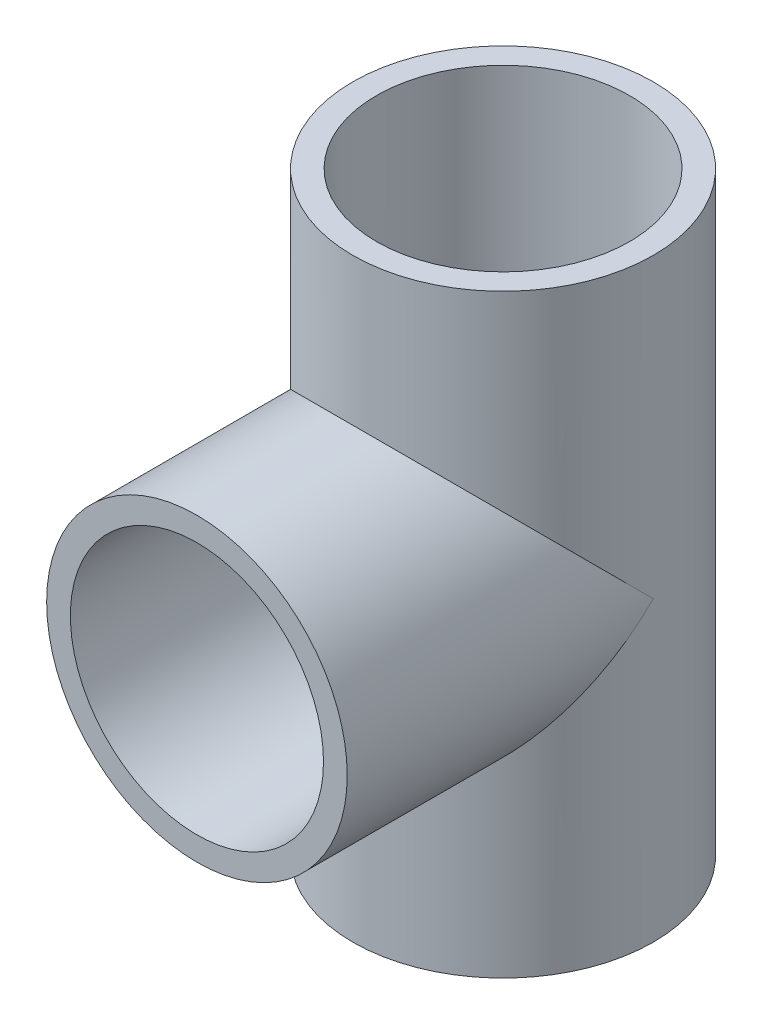
ISO-10303-21;
HEADER;
FILE_DESCRIPTION(('STEP AP214'),'2;1');
FILE_NAME('part.step','',(''),(''),'','','');
FILE_SCHEMA(('AUTOMOTIVE_DESIGN { 1 0 10303 214 1 1 1 1 }'));
ENDSEC;
DATA;
#1=APPLICATION_CONTEXT('core data for automotive mechanical design processes');
#2=APPLICATION_PROTOCOL_DEFINITION('international standard','automotive_design',2000,#1);
#3=PRODUCT_CONTEXT('',#1,'mechanical');
#4=PRODUCT('Part','Part','',(#3));
#5=PRODUCT_RELATED_PRODUCT_CATEGORY('part','',(#4));
#6=PRODUCT_DEFINITION_FORMATION('','',#4);
#7=PRODUCT_DEFINITION_CONTEXT('part definition',#1,'design');
#8=PRODUCT_DEFINITION('design','',#6,#7);
#9=PRODUCT_DEFINITION_SHAPE('','',#8);
#10=(LENGTH_UNIT() NAMED_UNIT(*) SI_UNIT(.MILLI.,.METRE.));
#11=(NAMED_UNIT(*) PLANE_ANGLE_UNIT() SI_UNIT($,.RADIAN.));
#12=(NAMED_UNIT(*) SI_UNIT($,.STERADIAN.) SOLID_ANGLE_UNIT());
#13=UNCERTAINTY_MEASURE_WITH_UNIT(LENGTH_MEASURE(1.E-05),#10,'distance_accuracy_value','');
#14=(GEOMETRIC_REPRESENTATION_CONTEXT(3) GLOBAL_UNCERTAINTY_ASSIGNED_CONTEXT((#13)) GLOBAL_UNIT_ASSIGNED_CONTEXT((#10,
#11,#12)) REPRESENTATION_CONTEXT('',''));
#15=CARTESIAN_POINT('',(0.,0.,0.));
#16=DIRECTION('',(0.,0.,1.));
#17=DIRECTION('',(1.,0.,0.));
#18=AXIS2_PLACEMENT_3D('',#15,#16,#17);
#19=CARTESIAN_POINT('',(0.,75.2,0.));
#20=DIRECTION('',(0.,-1.,0.));
#21=DIRECTION('',(0.,0.,-1.));
#22=AXIS2_PLACEMENT_3D('',#19,#20,#21);
#23=CYLINDRICAL_SURFACE('',#22,19.);
#24=CARTESIAN_POINT('',(0.,0.,0.));
#25=DIRECTION('',(0.,1.,0.));
#26=DIRECTION('',(0.,0.,1.));
#27=AXIS2_PLACEMENT_3D('',#24,#25,#26);
#28=CIRCLE('',#27,19.);
#29=CARTESIAN_POINT('',(0.,0.,19.));
#30=VERTEX_POINT('',#29);
#31=EDGE_CURVE('E54',#30,#30,#28,.T.);
#32=ORIENTED_EDGE('',*,*,#31,.T.);
#33=EDGE_LOOP('',(#32));
#34=FACE_BOUND('',#33,.T.);
#35=CARTESIAN_POINT('',(0.,75.2,0.));
#36=DIRECTION('',(0.,1.,0.));
#37=DIRECTION('',(0.,0.,1.));
#38=AXIS2_PLACEMENT_3D('',#35,#36,#37);
#39=CIRCLE('',#38,19.);
#40=CARTESIAN_POINT('',(0.,75.2,19.));
#41=VERTEX_POINT('',#40);
#42=EDGE_CURVE('E12',#41,#41,#39,.T.);
#43=ORIENTED_EDGE('',*,*,#42,.F.);
#44=EDGE_LOOP('',(#43));
#45=FACE_BOUND('',#44,.T.);
#46=CARTESIAN_POINT('',(0.,37.6,0.));
#47=DIRECTION('',(0.,-0.707106781186547,-0.707106781186547));
#48=DIRECTION('',(0.,-0.707106781186547,0.707106781186547));
#49=AXIS2_PLACEMENT_3D('',#46,#47,#48);
#50=ELLIPSE('',#49,26.8700576850888,19.);
#51=CARTESIAN_POINT('',(-19.,37.6,0.));
#52=VERTEX_POINT('',#51);
#53=CARTESIAN_POINT('',(19.,37.6,0.));
#54=VERTEX_POINT('',#53);
#55=EDGE_CURVE('E97',#52,#54,#50,.F.);
#56=ORIENTED_EDGE('',*,*,#55,.F.);
#57=CARTESIAN_POINT('',(0.,37.6,0.));
#58=DIRECTION('',(0.,-0.707106781186547,0.707106781186547));
#59=DIRECTION('',(0.,-0.707106781186547,-0.707106781186547));
#60=AXIS2_PLACEMENT_3D('',#57,#58,#59);
#61=ELLIPSE('',#60,26.8700576850888,19.);
#62=EDGE_CURVE('E72',#54,#52,#61,.T.);
#63=ORIENTED_EDGE('',*,*,#62,.F.);
#64=EDGE_LOOP('',(#56,#63));
#65=FACE_BOUND('',#64,.T.);
#66=ADVANCED_FACE('F51',(#34,#45,#65),#23,.T.);
#67=CARTESIAN_POINT('',(0.,75.2,0.));
#68=DIRECTION('',(0.,1.,0.));
#69=DIRECTION('',(0.,0.,1.));
#70=AXIS2_PLACEMENT_3D('',#67,#68,#69);
#71=PLANE('',#70);
#72=ORIENTED_EDGE('',*,*,#42,.T.);
#73=EDGE_LOOP('',(#72));
#74=FACE_BOUND('',#73,.T.);
#75=CARTESIAN_POINT('',(0.,75.2,0.));
#76=DIRECTION('',(0.,1.,0.));
#77=DIRECTION('',(0.,0.,1.));
#78=AXIS2_PLACEMENT_3D('',#75,#76,#77);
#79=CIRCLE('',#78,16.);
#80=CARTESIAN_POINT('',(0.,75.2,16.));
#81=VERTEX_POINT('',#80);
#82=EDGE_CURVE('E101',#81,#81,#79,.T.);
#83=ORIENTED_EDGE('',*,*,#82,.F.);
#84=EDGE_LOOP('',(#83));
#85=FACE_BOUND('',#84,.T.);
#86=ADVANCED_FACE('F122',(#74,#85),#71,.T.);
#87=CARTESIAN_POINT('',(0.,0.,0.));
#88=DIRECTION('',(0.,1.,0.));
#89=DIRECTION('',(0.,0.,1.));
#90=AXIS2_PLACEMENT_3D('',#87,#88,#89);
#91=PLANE('',#90);
#92=ORIENTED_EDGE('',*,*,#31,.F.);
#93=EDGE_LOOP('',(#92));
#94=FACE_BOUND('',#93,.T.);
#95=CARTESIAN_POINT('',(0.,0.,0.));
#96=DIRECTION('',(0.,1.,0.));
#97=DIRECTION('',(0.,0.,1.));
#98=AXIS2_PLACEMENT_3D('',#95,#96,#97);
#99=CIRCLE('',#98,16.);
#100=CARTESIAN_POINT('',(0.,0.,16.));
#101=VERTEX_POINT('',#100);
#102=EDGE_CURVE('E100',#101,#101,#99,.T.);
#103=ORIENTED_EDGE('',*,*,#102,.T.);
#104=EDGE_LOOP('',(#103));
#105=FACE_BOUND('',#104,.T.);
#106=ADVANCED_FACE('F109',(#94,#105),#91,.F.);
#107=CARTESIAN_POINT('',(0.,37.6,38.7));
#108=DIRECTION('',(0.,0.,-1.));
#109=DIRECTION('',(-1.,0.,0.));
#110=AXIS2_PLACEMENT_3D('',#107,#108,#109);
#111=CYLINDRICAL_SURFACE('',#110,19.);
#112=CARTESIAN_POINT('',(0.,37.6,38.7));
#113=DIRECTION('',(0.,0.,1.));
#114=DIRECTION('',(1.,0.,0.));
#115=AXIS2_PLACEMENT_3D('',#112,#113,#114);
#116=CIRCLE('',#115,19.);
#117=CARTESIAN_POINT('',(19.,37.6,38.7));
#118=VERTEX_POINT('',#117);
#119=EDGE_CURVE('E89',#118,#118,#116,.T.);
#120=ORIENTED_EDGE('',*,*,#119,.F.);
#121=EDGE_LOOP('',(#120));
#122=FACE_BOUND('',#121,.T.);
#123=ORIENTED_EDGE('',*,*,#62,.T.);
#124=ORIENTED_EDGE('',*,*,#55,.T.);
#125=EDGE_LOOP('',(#123,#124));
#126=FACE_BOUND('',#125,.T.);
#127=ADVANCED_FACE('F133',(#122,#126),#111,.T.);
#128=CARTESIAN_POINT('',(0.,37.6,38.7));
#129=DIRECTION('',(0.,0.,-1.));
#130=DIRECTION('',(-1.,0.,0.));
#131=AXIS2_PLACEMENT_3D('',#128,#129,#130);
#132=CYLINDRICAL_SURFACE('',#131,16.);
#133=CARTESIAN_POINT('',(0.,37.6,38.7));
#134=DIRECTION('',(0.,0.,1.));
#135=DIRECTION('',(1.,0.,0.));
#136=AXIS2_PLACEMENT_3D('',#133,#134,#135);
#137=CIRCLE('',#136,16.);
#138=CARTESIAN_POINT('',(16.,37.6,38.7));
#139=VERTEX_POINT('',#138);
#140=EDGE_CURVE('E85',#139,#139,#137,.T.);
#141=ORIENTED_EDGE('',*,*,#140,.T.);
#142=EDGE_LOOP('',(#141));
#143=FACE_BOUND('',#142,.T.);
#144=CARTESIAN_POINT('',(0.,37.6,0.));
#145=DIRECTION('',(0.,0.707106781186548,0.707106781186547));
#146=DIRECTION('',(0.,-0.707106781186548,0.707106781186547));
#147=AXIS2_PLACEMENT_3D('',#144,#145,#146);
#148=ELLIPSE('',#147,22.6274169979695,16.);
#149=CARTESIAN_POINT('',(-16.,37.6,0.));
#150=VERTEX_POINT('',#149);
#151=CARTESIAN_POINT('',(16.,37.6,0.));
#152=VERTEX_POINT('',#151);
#153=EDGE_CURVE('E77',#150,#152,#148,.T.);
#154=ORIENTED_EDGE('',*,*,#153,.F.);
#155=CARTESIAN_POINT('',(0.,37.6,0.));
#156=DIRECTION('',(0.,-0.707106781186548,0.707106781186547));
#157=DIRECTION('',(0.,0.707106781186548,0.707106781186547));
#158=AXIS2_PLACEMENT_3D('',#155,#156,#157);
#159=ELLIPSE('',#158,22.6274169979695,16.);
#160=EDGE_CURVE('E65',#152,#150,#159,.T.);
#161=ORIENTED_EDGE('',*,*,#160,.F.);
#162=EDGE_LOOP('',(#154,#161));
#163=FACE_BOUND('',#162,.T.);
#164=ADVANCED_FACE('F78',(#143,#163),#132,.F.);
#165=CARTESIAN_POINT('',(0.,37.6,38.7));
#166=DIRECTION('',(0.,0.,1.));
#167=DIRECTION('',(1.,0.,0.));
#168=AXIS2_PLACEMENT_3D('',#165,#166,#167);
#169=PLANE('',#168);
#170=ORIENTED_EDGE('',*,*,#119,.T.);
#171=EDGE_LOOP('',(#170));
#172=FACE_BOUND('',#171,.T.);
#173=ORIENTED_EDGE('',*,*,#140,.F.);
#174=EDGE_LOOP('',(#173));
#175=FACE_BOUND('',#174,.T.);
#176=ADVANCED_FACE('F112',(#172,#175),#169,.T.);
#177=CARTESIAN_POINT('',(0.,75.2,0.));
#178=DIRECTION('',(0.,-1.,0.));
#179=DIRECTION('',(0.,0.,-1.));
#180=AXIS2_PLACEMENT_3D('',#177,#178,#179);
#181=CYLINDRICAL_SURFACE('',#180,16.);
#182=ORIENTED_EDGE('',*,*,#160,.T.);
#183=ORIENTED_EDGE('',*,*,#153,.T.);
#184=EDGE_LOOP('',(#182,#183));
#185=FACE_BOUND('',#184,.T.);
#186=ORIENTED_EDGE('',*,*,#82,.T.);
#187=EDGE_LOOP('',(#186));
#188=FACE_BOUND('',#187,.T.);
#189=ORIENTED_EDGE('',*,*,#102,.F.);
#190=EDGE_LOOP('',(#189));
#191=FACE_BOUND('',#190,.T.);
#192=ADVANCED_FACE('F82',(#185,#188,#191),#181,.F.);
#193=CLOSED_SHELL('',(#66,#86,#106,#127,#164,#176,#192));
#194=MANIFOLD_SOLID_BREP('B2',#193);
#195=ADVANCED_BREP_SHAPE_REPRESENTATION('',(#18,#194),#14);
#196=SHAPE_DEFINITION_REPRESENTATION(#9,#195);
ENDSEC;
END-ISO-10303-21;
